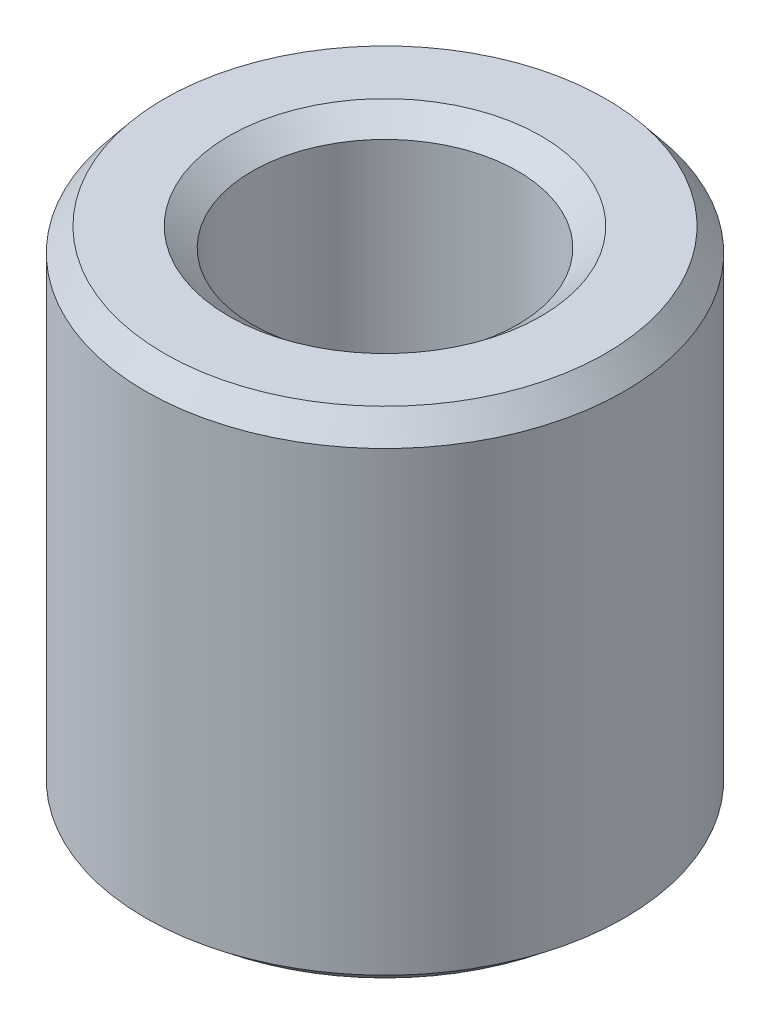
ISO-10303-21;
HEADER;
FILE_DESCRIPTION(('STEP AP214'),'2;1');
FILE_NAME('part.step','',(''),(''),'','','');
FILE_SCHEMA(('AUTOMOTIVE_DESIGN { 1 0 10303 214 1 1 1 1 }'));
ENDSEC;
DATA;
#1=APPLICATION_CONTEXT('core data for automotive mechanical design processes');
#2=APPLICATION_PROTOCOL_DEFINITION('international standard','automotive_design',2000,#1);
#3=PRODUCT_CONTEXT('',#1,'mechanical');
#4=PRODUCT('Part','Part','',(#3));
#5=PRODUCT_RELATED_PRODUCT_CATEGORY('part','',(#4));
#6=PRODUCT_DEFINITION_FORMATION('','',#4);
#7=PRODUCT_DEFINITION_CONTEXT('part definition',#1,'design');
#8=PRODUCT_DEFINITION('design','',#6,#7);
#9=PRODUCT_DEFINITION_SHAPE('','',#8);
#10=(LENGTH_UNIT() NAMED_UNIT(*) SI_UNIT(.MILLI.,.METRE.));
#11=(NAMED_UNIT(*) PLANE_ANGLE_UNIT() SI_UNIT($,.RADIAN.));
#12=(NAMED_UNIT(*) SI_UNIT($,.STERADIAN.) SOLID_ANGLE_UNIT());
#13=UNCERTAINTY_MEASURE_WITH_UNIT(LENGTH_MEASURE(1.E-05),#10,'distance_accuracy_value','');
#14=(GEOMETRIC_REPRESENTATION_CONTEXT(3) GLOBAL_UNCERTAINTY_ASSIGNED_CONTEXT((#13)) GLOBAL_UNIT_ASSIGNED_CONTEXT((#10,
#11,#12)) REPRESENTATION_CONTEXT('',''));
#15=CARTESIAN_POINT('',(0.,0.,0.));
#16=DIRECTION('',(0.,0.,1.));
#17=DIRECTION('',(1.,0.,0.));
#18=AXIS2_PLACEMENT_3D('',#15,#16,#17);
#19=CARTESIAN_POINT('',(0.,62.4109664134684,0.));
#20=DIRECTION('',(0.,-1.,0.));
#21=DIRECTION('',(0.,0.,-1.));
#22=AXIS2_PLACEMENT_3D('',#19,#20,#21);
#23=CYLINDRICAL_SURFACE('',#22,30.);
#24=CARTESIAN_POINT('',(0.,2.35959420550855,0.));
#25=DIRECTION('',(0.,1.,0.));
#26=DIRECTION('',(0.,0.,1.));
#27=AXIS2_PLACEMENT_3D('',#24,#25,#26);
#28=CIRCLE('',#27,30.);
#29=CARTESIAN_POINT('',(0.,2.35959420550855,30.));
#30=VERTEX_POINT('',#29);
#31=EDGE_CURVE('E10',#30,#30,#28,.T.);
#32=ORIENTED_EDGE('',*,*,#31,.T.);
#33=EDGE_LOOP('',(#32));
#34=FACE_BOUND('',#33,.T.);
#35=CARTESIAN_POINT('',(0.,59.4942180305381,0.));
#36=DIRECTION('',(0.,1.,0.));
#37=DIRECTION('',(0.,0.,1.));
#38=AXIS2_PLACEMENT_3D('',#35,#36,#37);
#39=CIRCLE('',#38,30.);
#40=CARTESIAN_POINT('',(0.,59.4942180305381,30.));
#41=VERTEX_POINT('',#40);
#42=EDGE_CURVE('E50',#41,#41,#39,.F.);
#43=ORIENTED_EDGE('',*,*,#42,.T.);
#44=EDGE_LOOP('',(#43));
#45=FACE_BOUND('',#44,.T.);
#46=ADVANCED_FACE('F39',(#34,#45),#23,.T.);
#47=CARTESIAN_POINT('',(0.,62.4109664134684,0.));
#48=DIRECTION('',(0.,1.,0.));
#49=DIRECTION('',(0.,0.,1.));
#50=AXIS2_PLACEMENT_3D('',#47,#48,#49);
#51=PLANE('',#50);
#52=CARTESIAN_POINT('',(0.,62.4109664134684,0.));
#53=DIRECTION('',(0.,1.,0.));
#54=DIRECTION('',(0.,0.,1.));
#55=AXIS2_PLACEMENT_3D('',#52,#53,#54);
#56=CIRCLE('',#55,19.5570369239387);
#57=CARTESIAN_POINT('',(0.,62.4109664134684,19.5570369239387));
#58=VERTEX_POINT('',#57);
#59=EDGE_CURVE('E58',#58,#58,#56,.F.);
#60=ORIENTED_EDGE('',*,*,#59,.T.);
#61=EDGE_LOOP('',(#60));
#62=FACE_BOUND('',#61,.T.);
#63=CARTESIAN_POINT('',(0.,62.4109664134684,0.));
#64=DIRECTION('',(0.,1.,0.));
#65=DIRECTION('',(0.,0.,1.));
#66=AXIS2_PLACEMENT_3D('',#63,#64,#65);
#67=CIRCLE('',#66,27.6404057944914);
#68=CARTESIAN_POINT('',(0.,62.4109664134684,27.6404057944914));
#69=VERTEX_POINT('',#68);
#70=EDGE_CURVE('E61',#69,#69,#67,.T.);
#71=ORIENTED_EDGE('',*,*,#70,.T.);
#72=EDGE_LOOP('',(#71));
#73=FACE_BOUND('',#72,.T.);
#74=ADVANCED_FACE('F88',(#62,#73),#51,.T.);
#75=CARTESIAN_POINT('',(0.,0.,0.));
#76=DIRECTION('',(0.,1.,0.));
#77=DIRECTION('',(0.,0.,1.));
#78=AXIS2_PLACEMENT_3D('',#75,#76,#77);
#79=PLANE('',#78);
#80=CARTESIAN_POINT('',(0.,0.,0.));
#81=DIRECTION('',(0.,1.,0.));
#82=DIRECTION('',(0.,0.,1.));
#83=AXIS2_PLACEMENT_3D('',#80,#81,#82);
#84=CIRCLE('',#83,18.9998827465169);
#85=CARTESIAN_POINT('',(0.,0.,18.9998827465169));
#86=VERTEX_POINT('',#85);
#87=EDGE_CURVE('E51',#86,#86,#84,.T.);
#88=ORIENTED_EDGE('',*,*,#87,.T.);
#89=EDGE_LOOP('',(#88));
#90=FACE_BOUND('',#89,.T.);
#91=CARTESIAN_POINT('',(0.,0.,0.));
#92=DIRECTION('',(0.,1.,0.));
#93=DIRECTION('',(0.,0.,1.));
#94=AXIS2_PLACEMENT_3D('',#91,#92,#93);
#95=CIRCLE('',#94,27.0832516170697);
#96=CARTESIAN_POINT('',(0.,0.,27.0832516170697));
#97=VERTEX_POINT('',#96);
#98=EDGE_CURVE('E54',#97,#97,#95,.F.);
#99=ORIENTED_EDGE('',*,*,#98,.T.);
#100=EDGE_LOOP('',(#99));
#101=FACE_BOUND('',#100,.T.);
#102=ADVANCED_FACE('F83',(#90,#101),#79,.F.);
#103=CARTESIAN_POINT('',(0.,62.4109664134684,0.));
#104=DIRECTION('',(0.,-1.,0.));
#105=DIRECTION('',(0.,0.,-1.));
#106=AXIS2_PLACEMENT_3D('',#103,#104,#105);
#107=CYLINDRICAL_SURFACE('',#106,16.6402885410083);
#108=CARTESIAN_POINT('',(0.,60.0513722079598,0.));
#109=DIRECTION('',(0.,1.,0.));
#110=DIRECTION('',(0.,0.,1.));
#111=AXIS2_PLACEMENT_3D('',#108,#109,#110);
#112=CIRCLE('',#111,16.6402885410083);
#113=CARTESIAN_POINT('',(0.,60.0513722079598,16.6402885410083));
#114=VERTEX_POINT('',#113);
#115=EDGE_CURVE('E67',#114,#114,#112,.T.);
#116=ORIENTED_EDGE('',*,*,#115,.T.);
#117=EDGE_LOOP('',(#116));
#118=FACE_BOUND('',#117,.T.);
#119=CARTESIAN_POINT('',(0.,2.91674838293031,0.));
#120=DIRECTION('',(0.,1.,0.));
#121=DIRECTION('',(0.,0.,1.));
#122=AXIS2_PLACEMENT_3D('',#119,#120,#121);
#123=CIRCLE('',#122,16.6402885410083);
#124=CARTESIAN_POINT('',(0.,2.91674838293031,16.6402885410083));
#125=VERTEX_POINT('',#124);
#126=EDGE_CURVE('E69',#125,#125,#123,.F.);
#127=ORIENTED_EDGE('',*,*,#126,.T.);
#128=EDGE_LOOP('',(#127));
#129=FACE_BOUND('',#128,.T.);
#130=ADVANCED_FACE('F71',(#118,#129),#107,.F.);
#131=CARTESIAN_POINT('',(0.,60.0513722079598,0.));
#132=DIRECTION('',(0.,1.,0.));
#133=DIRECTION('',(0.,0.,1.));
#134=AXIS2_PLACEMENT_3D('',#131,#132,#133);
#135=CONICAL_SURFACE('',#134,16.6402885410083,0.890603067922444);
#136=CARTESIAN_POINT('',(0.,62.4109664134684,19.5570369239387));
#137=CARTESIAN_POINT('',(0.,62.386387307161,19.5266541282832));
#138=CARTESIAN_POINT('',(0.,62.3618082008536,19.4962713326276));
#139=CARTESIAN_POINT('',(0.,62.3126499882389,19.4355057413166));
#140=CARTESIAN_POINT('',(0.,62.2880708819315,19.4051229456611));
#141=CARTESIAN_POINT('',(0.,62.2389126693167,19.34435735435));
#142=CARTESIAN_POINT('',(0.,62.2143335630093,19.3139745586945));
#143=CARTESIAN_POINT('',(0.,62.1651753503946,19.2532089673834));
#144=CARTESIAN_POINT('',(0.,62.1405962440872,19.2228261717279));
#145=CARTESIAN_POINT('',(0.,62.0914380314724,19.1620605804169));
#146=CARTESIAN_POINT('',(0.,62.066858925165,19.1316777847613));
#147=CARTESIAN_POINT('',(0.,62.0177007125503,19.0709121934503));
#148=CARTESIAN_POINT('',(0.,61.9931216062429,19.0405293977948));
#149=CARTESIAN_POINT('',(0.,61.9439633936281,18.9797638064837));
#150=CARTESIAN_POINT('',(0.,61.9193842873208,18.9493810108282));
#151=CARTESIAN_POINT('',(0.,61.870226074706,18.8886154195171));
#152=CARTESIAN_POINT('',(0.,61.8456469683986,18.8582326238616));
#153=CARTESIAN_POINT('',(0.,61.7964887557838,18.7974670325506));
#154=CARTESIAN_POINT('',(0.,61.7719096494765,18.767084236895));
#155=CARTESIAN_POINT('',(0.,61.7227514368617,18.706318645584));
#156=CARTESIAN_POINT('',(0.,61.6981723305543,18.6759358499285));
#157=CARTESIAN_POINT('',(0.,61.6490141179396,18.6151702586174));
#158=CARTESIAN_POINT('',(0.,61.6244350116322,18.5847874629619));
#159=CARTESIAN_POINT('',(0.,61.5752767990174,18.5240218716509));
#160=CARTESIAN_POINT('',(0.,61.55069769271,18.4936390759953));
#161=CARTESIAN_POINT('',(0.,61.5015394800953,18.4328734846843));
#162=CARTESIAN_POINT('',(0.,61.4769603737879,18.4024906890288));
#163=CARTESIAN_POINT('',(0.,61.4278021611731,18.3417250977177));
#164=CARTESIAN_POINT('',(0.,61.4032230548658,18.3113423020622));
#165=CARTESIAN_POINT('',(0.,61.354064842251,18.2505767107511));
#166=CARTESIAN_POINT('',(0.,61.3294857359436,18.2201939150956));
#167=CARTESIAN_POINT('',(0.,61.2803275233289,18.1594283237846));
#168=CARTESIAN_POINT('',(0.,61.2557484170215,18.129045528129));
#169=CARTESIAN_POINT('',(0.,61.2065902044067,18.068279936818));
#170=CARTESIAN_POINT('',(0.,61.1820110980993,18.0378971411625));
#171=CARTESIAN_POINT('',(0.,61.1328528854846,17.9771315498514));
#172=CARTESIAN_POINT('',(0.,61.1082737791772,17.9467487541959));
#173=CARTESIAN_POINT('',(0.,61.0591155665624,17.8859831628848));
#174=CARTESIAN_POINT('',(0.,61.034536460255,17.8556003672293));
#175=CARTESIAN_POINT('',(0.,60.9853782476403,17.7948347759183));
#176=CARTESIAN_POINT('',(0.,60.9607991413329,17.7644519802627));
#177=CARTESIAN_POINT('',(0.,60.9116409287181,17.7036863889517));
#178=CARTESIAN_POINT('',(0.,60.8870618224108,17.6733035932962));
#179=CARTESIAN_POINT('',(0.,60.837903609796,17.6125380019851));
#180=CARTESIAN_POINT('',(0.,60.8133245034886,17.5821552063296));
#181=CARTESIAN_POINT('',(0.,60.7641662908738,17.5213896150185));
#182=CARTESIAN_POINT('',(0.,60.7395871845665,17.491006819363));
#183=CARTESIAN_POINT('',(0.,60.6904289719517,17.430241228052));
#184=CARTESIAN_POINT('',(0.,60.6658498656443,17.3998584323964));
#185=CARTESIAN_POINT('',(0.,60.6166916530296,17.3390928410854));
#186=CARTESIAN_POINT('',(0.,60.5921125467222,17.3087100454299));
#187=CARTESIAN_POINT('',(0.,60.5429543341074,17.2479444541188));
#188=CARTESIAN_POINT('',(0.,60.5183752278,17.2175616584633));
#189=CARTESIAN_POINT('',(0.,60.4692170151853,17.1567960671523));
#190=CARTESIAN_POINT('',(0.,60.4446379088779,17.1264132714967));
#191=CARTESIAN_POINT('',(0.,60.3954796962631,17.0656476801857));
#192=CARTESIAN_POINT('',(0.,60.3709005899558,17.0352648845302));
#193=CARTESIAN_POINT('',(0.,60.321742377341,16.9744992932191));
#194=CARTESIAN_POINT('',(0.,60.2971632710336,16.9441164975636));
#195=CARTESIAN_POINT('',(0.,60.2480050584188,16.8833509062525));
#196=CARTESIAN_POINT('',(0.,60.2234259521115,16.852968110597));
#197=CARTESIAN_POINT('',(0.,60.1742677394967,16.792202519286));
#198=CARTESIAN_POINT('',(0.,60.1496886331893,16.7618197236304));
#199=CARTESIAN_POINT('',(0.,60.1005304205746,16.7010541323194));
#200=CARTESIAN_POINT('',(0.,60.0759513142672,16.6706713366639));
#201=CARTESIAN_POINT('',(0.,60.0513722079598,16.6402885410083));
#202=B_SPLINE_CURVE_WITH_KNOTS('',3,(#136,#137,#138,#139,#140,#141,#142,#143,#144,#145,#146,
#147,#148,#149,#150,#151,#152,#153,#154,#155,#156,#157,#158,#159,#160,#161,#162,#163,#164,#165,
#166,#167,#168,#169,#170,#171,#172,#173,#174,#175,#176,#177,#178,#179,#180,#181,#182,#183,#184,
#185,#186,#187,#188,#189,#190,#191,#192,#193,#194,#195,#196,#197,#198,#199,#200,#201),
.UNSPECIFIED.,.F.,.F.,(4,2,2,2,2,2,2,2,2,2,2,2,2,2,2,2,2,2,2,2,2,2,2,2,2,2,2,2,2,2,2,2,4),(0.,
0.117240013000826,0.234480026001655,0.351720039002481,0.468960052003307,0.586200065004134,
0.70344007800496,0.820680091005788,0.937920104006615,1.05516011700744,1.17240013000827,
1.28964014300909,1.40688015600992,1.52412016901075,1.64136018201157,1.7586001950124,
1.87584020801323,1.99308022101406,2.11032023401488,2.22756024701571,2.34480026001653,
2.46204027301736,2.57928028601819,2.69652029901902,2.81376031201984,2.93100032502067,
3.04824033802149,3.16548035102232,3.28272036402315,3.39996037702398,3.5172003900248,
3.63444040302563,3.75168041602645),.UNSPECIFIED.);
#203=EDGE_CURVE('BSEAM77',#58,#114,#202,.T.);
#204=ORIENTED_EDGE('',*,*,#59,.F.);
#205=ORIENTED_EDGE('',*,*,#115,.F.);
#206=ORIENTED_EDGE('',*,*,#203,.T.);
#207=ORIENTED_EDGE('',*,*,#203,.F.);
#208=EDGE_LOOP('',(#204,#206,#205,#207));
#209=FACE_BOUND('',#208,.T.);
#210=ADVANCED_FACE('F77',(#209),#135,.F.);
#211=CARTESIAN_POINT('',(0.,0.,0.));
#212=DIRECTION('',(0.,-1.,0.));
#213=DIRECTION('',(0.,0.,-1.));
#214=AXIS2_PLACEMENT_3D('',#211,#212,#213);
#215=CONICAL_SURFACE('',#214,18.9998827465169,0.680193258872451);
#216=ORIENTED_EDGE('',*,*,#126,.F.);
#217=EDGE_LOOP('',(#216));
#218=FACE_BOUND('',#217,.T.);
#219=ORIENTED_EDGE('',*,*,#87,.F.);
#220=EDGE_LOOP('',(#219));
#221=FACE_BOUND('',#220,.T.);
#222=ADVANCED_FACE('F73',(#218,#221),#215,.F.);
#223=CARTESIAN_POINT('',(0.,2.35959420550855,0.));
#224=DIRECTION('',(0.,1.,0.));
#225=DIRECTION('',(0.,0.,1.));
#226=AXIS2_PLACEMENT_3D('',#223,#224,#225);
#227=CONICAL_SURFACE('',#226,30.,0.890603067922445);
#228=ORIENTED_EDGE('',*,*,#98,.F.);
#229=EDGE_LOOP('',(#228));
#230=FACE_BOUND('',#229,.T.);
#231=ORIENTED_EDGE('',*,*,#31,.F.);
#232=EDGE_LOOP('',(#231));
#233=FACE_BOUND('',#232,.T.);
#234=ADVANCED_FACE('F76',(#230,#233),#227,.T.);
#235=CARTESIAN_POINT('',(0.,62.4109664134684,0.));
#236=DIRECTION('',(0.,-1.,0.));
#237=DIRECTION('',(0.,0.,-1.));
#238=AXIS2_PLACEMENT_3D('',#235,#236,#237);
#239=CONICAL_SURFACE('',#238,27.6404057944914,0.680193258872449);
#240=ORIENTED_EDGE('',*,*,#42,.F.);
#241=EDGE_LOOP('',(#240));
#242=FACE_BOUND('',#241,.T.);
#243=ORIENTED_EDGE('',*,*,#70,.F.);
#244=EDGE_LOOP('',(#243));
#245=FACE_BOUND('',#244,.T.);
#246=ADVANCED_FACE('F45',(#242,#245),#239,.T.);
#247=CLOSED_SHELL('',(#46,#74,#102,#130,#210,#222,#234,#246));
#248=MANIFOLD_SOLID_BREP('B2',#247);
#249=ADVANCED_BREP_SHAPE_REPRESENTATION('',(#18,#248),#14);
#250=SHAPE_DEFINITION_REPRESENTATION(#9,#249);
ENDSEC;
END-ISO-10303-21;
